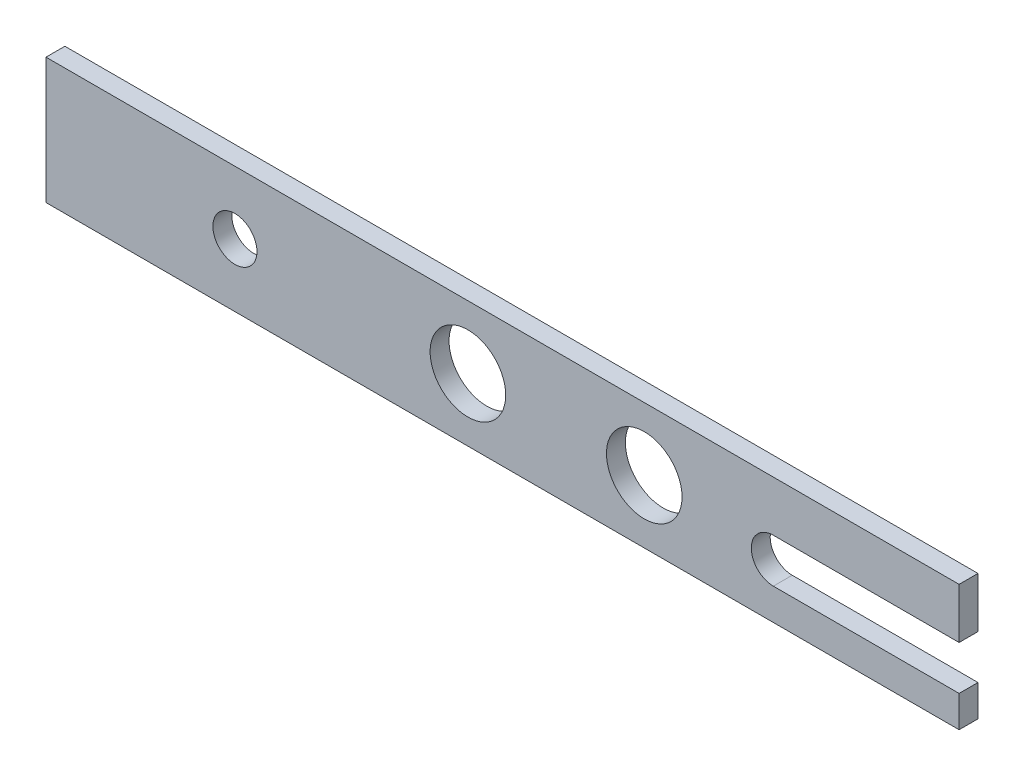
ISO-10303-21;
HEADER;
FILE_DESCRIPTION(('STEP AP214'),'2;1');
FILE_NAME('part.step','',(''),(''),'','','');
FILE_SCHEMA(('AUTOMOTIVE_DESIGN { 1 0 10303 214 1 1 1 1 }'));
ENDSEC;
DATA;
#1=APPLICATION_CONTEXT('core data for automotive mechanical design processes');
#2=APPLICATION_PROTOCOL_DEFINITION('international standard','automotive_design',2000,#1);
#3=PRODUCT_CONTEXT('',#1,'mechanical');
#4=PRODUCT('Part','Part','',(#3));
#5=PRODUCT_RELATED_PRODUCT_CATEGORY('part','',(#4));
#6=PRODUCT_DEFINITION_FORMATION('','',#4);
#7=PRODUCT_DEFINITION_CONTEXT('part definition',#1,'design');
#8=PRODUCT_DEFINITION('design','',#6,#7);
#9=PRODUCT_DEFINITION_SHAPE('','',#8);
#10=(LENGTH_UNIT() NAMED_UNIT(*) SI_UNIT(.MILLI.,.METRE.));
#11=(NAMED_UNIT(*) PLANE_ANGLE_UNIT() SI_UNIT($,.RADIAN.));
#12=(NAMED_UNIT(*) SI_UNIT($,.STERADIAN.) SOLID_ANGLE_UNIT());
#13=UNCERTAINTY_MEASURE_WITH_UNIT(LENGTH_MEASURE(1.E-05),#10,'distance_accuracy_value','');
#14=(GEOMETRIC_REPRESENTATION_CONTEXT(3) GLOBAL_UNCERTAINTY_ASSIGNED_CONTEXT((#13)) GLOBAL_UNIT_ASSIGNED_CONTEXT((#10,
#11,#12)) REPRESENTATION_CONTEXT('',''));
#15=CARTESIAN_POINT('',(0.,0.,0.));
#16=DIRECTION('',(0.,0.,1.));
#17=DIRECTION('',(1.,0.,0.));
#18=AXIS2_PLACEMENT_3D('',#15,#16,#17);
#19=CARTESIAN_POINT('',(0.,4.99999999999998,3.));
#20=DIRECTION('',(0.,-1.,0.));
#21=DIRECTION('',(1.,0.,0.));
#22=AXIS2_PLACEMENT_3D('',#19,#20,#21);
#23=PLANE('',#22);
#24=DIRECTION('',(-1.,0.,0.));
#25=VECTOR('',#24,1.);
#26=CARTESIAN_POINT('',(0.,4.99999999999998,0.));
#27=LINE('',#26,#25);
#28=CARTESIAN_POINT('',(145.,5.,0.));
#29=VERTEX_POINT('',#28);
#30=CARTESIAN_POINT('',(115.5,5.,0.));
#31=VERTEX_POINT('',#30);
#32=EDGE_CURVE('E154',#29,#31,#27,.T.);
#33=ORIENTED_EDGE('',*,*,#32,.T.);
#34=DIRECTION('',(0.,0.,-1.));
#35=VECTOR('',#34,1.);
#36=CARTESIAN_POINT('',(115.5,5.,3.));
#37=LINE('',#36,#35);
#38=CARTESIAN_POINT('',(115.5,5.,3.));
#39=VERTEX_POINT('',#38);
#40=EDGE_CURVE('E11',#39,#31,#37,.T.);
#41=ORIENTED_EDGE('',*,*,#40,.F.);
#42=DIRECTION('',(-1.,0.,0.));
#43=VECTOR('',#42,1.);
#44=CARTESIAN_POINT('',(0.,4.99999999999998,3.));
#45=LINE('',#44,#43);
#46=CARTESIAN_POINT('',(145.,5.,3.));
#47=VERTEX_POINT('',#46);
#48=EDGE_CURVE('E212',#47,#39,#45,.T.);
#49=ORIENTED_EDGE('',*,*,#48,.F.);
#50=DIRECTION('',(0.,0.,-1.));
#51=VECTOR('',#50,1.);
#52=CARTESIAN_POINT('',(145.,5.,3.));
#53=LINE('',#52,#51);
#54=EDGE_CURVE('E178',#47,#29,#53,.T.);
#55=ORIENTED_EDGE('',*,*,#54,.T.);
#56=EDGE_LOOP('',(#33,#41,#49,#55));
#57=FACE_BOUND('',#56,.T.);
#58=ADVANCED_FACE('F41',(#57),#23,.F.);
#59=CARTESIAN_POINT('',(115.5,8.5,3.));
#60=DIRECTION('',(0.,0.,-1.));
#61=DIRECTION('',(-1.,0.,0.));
#62=AXIS2_PLACEMENT_3D('',#59,#60,#61);
#63=CYLINDRICAL_SURFACE('',#62,3.5);
#64=CARTESIAN_POINT('',(115.5,8.5,0.));
#65=DIRECTION('',(0.,0.,1.));
#66=DIRECTION('',(1.,0.,0.));
#67=AXIS2_PLACEMENT_3D('',#64,#65,#66);
#68=CIRCLE('',#67,3.5);
#69=CARTESIAN_POINT('',(115.5,12.,0.));
#70=VERTEX_POINT('',#69);
#71=EDGE_CURVE('E158',#31,#70,#68,.F.);
#72=ORIENTED_EDGE('',*,*,#71,.T.);
#73=DIRECTION('',(0.,0.,-1.));
#74=VECTOR('',#73,1.);
#75=CARTESIAN_POINT('',(115.5,12.,3.));
#76=LINE('',#75,#74);
#77=CARTESIAN_POINT('',(115.5,12.,3.));
#78=VERTEX_POINT('',#77);
#79=EDGE_CURVE('E51',#78,#70,#76,.T.);
#80=ORIENTED_EDGE('',*,*,#79,.F.);
#81=CARTESIAN_POINT('',(115.5,8.5,3.));
#82=DIRECTION('',(0.,0.,1.));
#83=DIRECTION('',(1.,0.,0.));
#84=AXIS2_PLACEMENT_3D('',#81,#82,#83);
#85=CIRCLE('',#84,3.5);
#86=EDGE_CURVE('E101',#39,#78,#85,.F.);
#87=ORIENTED_EDGE('',*,*,#86,.F.);
#88=ORIENTED_EDGE('',*,*,#40,.T.);
#89=EDGE_LOOP('',(#72,#80,#87,#88));
#90=FACE_BOUND('',#89,.T.);
#91=ADVANCED_FACE('F197',(#90),#63,.F.);
#92=CARTESIAN_POINT('',(0.,12.,3.));
#93=DIRECTION('',(0.,-1.,0.));
#94=DIRECTION('',(1.,0.,0.));
#95=AXIS2_PLACEMENT_3D('',#92,#93,#94);
#96=PLANE('',#95);
#97=DIRECTION('',(-1.,0.,0.));
#98=VECTOR('',#97,1.);
#99=CARTESIAN_POINT('',(0.,12.,0.));
#100=LINE('',#99,#98);
#101=CARTESIAN_POINT('',(145.,12.,0.));
#102=VERTEX_POINT('',#101);
#103=EDGE_CURVE('E162',#102,#70,#100,.T.);
#104=ORIENTED_EDGE('',*,*,#103,.F.);
#105=DIRECTION('',(0.,0.,-1.));
#106=VECTOR('',#105,1.);
#107=CARTESIAN_POINT('',(145.,12.,3.));
#108=LINE('',#107,#106);
#109=CARTESIAN_POINT('',(145.,12.,3.));
#110=VERTEX_POINT('',#109);
#111=EDGE_CURVE('E188',#110,#102,#108,.T.);
#112=ORIENTED_EDGE('',*,*,#111,.F.);
#113=DIRECTION('',(-1.,0.,0.));
#114=VECTOR('',#113,1.);
#115=CARTESIAN_POINT('',(0.,12.,3.));
#116=LINE('',#115,#114);
#117=EDGE_CURVE('E196',#110,#78,#116,.T.);
#118=ORIENTED_EDGE('',*,*,#117,.T.);
#119=ORIENTED_EDGE('',*,*,#79,.T.);
#120=EDGE_LOOP('',(#104,#112,#118,#119));
#121=FACE_BOUND('',#120,.T.);
#122=ADVANCED_FACE('F194',(#121),#96,.T.);
#123=CARTESIAN_POINT('',(145.,0.,3.));
#124=DIRECTION('',(-1.,0.,0.));
#125=DIRECTION('',(0.,0.,1.));
#126=AXIS2_PLACEMENT_3D('',#123,#124,#125);
#127=PLANE('',#126);
#128=DIRECTION('',(0.,1.,0.));
#129=VECTOR('',#128,1.);
#130=CARTESIAN_POINT('',(145.,0.,0.));
#131=LINE('',#130,#129);
#132=CARTESIAN_POINT('',(145.,20.,0.));
#133=VERTEX_POINT('',#132);
#134=EDGE_CURVE('E166',#102,#133,#131,.T.);
#135=ORIENTED_EDGE('',*,*,#134,.T.);
#136=DIRECTION('',(0.,0.,-1.));
#137=VECTOR('',#136,1.);
#138=CARTESIAN_POINT('',(145.,20.,3.));
#139=LINE('',#138,#137);
#140=CARTESIAN_POINT('',(145.,20.,3.));
#141=VERTEX_POINT('',#140);
#142=EDGE_CURVE('E185',#141,#133,#139,.T.);
#143=ORIENTED_EDGE('',*,*,#142,.F.);
#144=DIRECTION('',(0.,1.,0.));
#145=VECTOR('',#144,1.);
#146=CARTESIAN_POINT('',(145.,0.,3.));
#147=LINE('',#146,#145);
#148=EDGE_CURVE('E138',#110,#141,#147,.T.);
#149=ORIENTED_EDGE('',*,*,#148,.F.);
#150=ORIENTED_EDGE('',*,*,#111,.T.);
#151=EDGE_LOOP('',(#135,#143,#149,#150));
#152=FACE_BOUND('',#151,.T.);
#153=ADVANCED_FACE('F206',(#152),#127,.F.);
#154=CARTESIAN_POINT('',(0.,20.,3.));
#155=DIRECTION('',(0.,1.,0.));
#156=DIRECTION('',(0.,0.,1.));
#157=AXIS2_PLACEMENT_3D('',#154,#155,#156);
#158=PLANE('',#157);
#159=DIRECTION('',(1.,0.,0.));
#160=VECTOR('',#159,1.);
#161=CARTESIAN_POINT('',(0.,20.,0.));
#162=LINE('',#161,#160);
#163=CARTESIAN_POINT('',(0.,20.,0.));
#164=VERTEX_POINT('',#163);
#165=EDGE_CURVE('E170',#164,#133,#162,.T.);
#166=ORIENTED_EDGE('',*,*,#165,.F.);
#167=DIRECTION('',(0.,0.,-1.));
#168=VECTOR('',#167,1.);
#169=CARTESIAN_POINT('',(0.,20.,3.));
#170=LINE('',#169,#168);
#171=CARTESIAN_POINT('',(0.,20.,3.));
#172=VERTEX_POINT('',#171);
#173=EDGE_CURVE('E124',#172,#164,#170,.T.);
#174=ORIENTED_EDGE('',*,*,#173,.F.);
#175=DIRECTION('',(1.,0.,0.));
#176=VECTOR('',#175,1.);
#177=CARTESIAN_POINT('',(0.,20.,3.));
#178=LINE('',#177,#176);
#179=EDGE_CURVE('E134',#172,#141,#178,.T.);
#180=ORIENTED_EDGE('',*,*,#179,.T.);
#181=ORIENTED_EDGE('',*,*,#142,.T.);
#182=EDGE_LOOP('',(#166,#174,#180,#181));
#183=FACE_BOUND('',#182,.T.);
#184=ADVANCED_FACE('F277',(#183),#158,.T.);
#185=CARTESIAN_POINT('',(0.,0.,3.));
#186=DIRECTION('',(-1.,0.,0.));
#187=DIRECTION('',(0.,0.,1.));
#188=AXIS2_PLACEMENT_3D('',#185,#186,#187);
#189=PLANE('',#188);
#190=DIRECTION('',(0.,1.,0.));
#191=VECTOR('',#190,1.);
#192=CARTESIAN_POINT('',(0.,0.,0.));
#193=LINE('',#192,#191);
#194=CARTESIAN_POINT('',(0.,0.,0.));
#195=VERTEX_POINT('',#194);
#196=EDGE_CURVE('E122',#195,#164,#193,.T.);
#197=ORIENTED_EDGE('',*,*,#196,.F.);
#198=DIRECTION('',(0.,0.,-1.));
#199=VECTOR('',#198,1.);
#200=CARTESIAN_POINT('',(0.,0.,3.));
#201=LINE('',#200,#199);
#202=CARTESIAN_POINT('',(0.,0.,3.));
#203=VERTEX_POINT('',#202);
#204=EDGE_CURVE('E116',#203,#195,#201,.T.);
#205=ORIENTED_EDGE('',*,*,#204,.F.);
#206=DIRECTION('',(0.,1.,0.));
#207=VECTOR('',#206,1.);
#208=CARTESIAN_POINT('',(0.,0.,3.));
#209=LINE('',#208,#207);
#210=EDGE_CURVE('E120',#203,#172,#209,.T.);
#211=ORIENTED_EDGE('',*,*,#210,.T.);
#212=ORIENTED_EDGE('',*,*,#173,.T.);
#213=EDGE_LOOP('',(#197,#205,#211,#212));
#214=FACE_BOUND('',#213,.T.);
#215=ADVANCED_FACE('F118',(#214),#189,.T.);
#216=CARTESIAN_POINT('',(0.,0.,3.));
#217=DIRECTION('',(0.,1.,0.));
#218=DIRECTION('',(0.,0.,1.));
#219=AXIS2_PLACEMENT_3D('',#216,#217,#218);
#220=PLANE('',#219);
#221=DIRECTION('',(1.,0.,0.));
#222=VECTOR('',#221,1.);
#223=CARTESIAN_POINT('',(0.,0.,0.));
#224=LINE('',#223,#222);
#225=CARTESIAN_POINT('',(145.,0.,0.));
#226=VERTEX_POINT('',#225);
#227=EDGE_CURVE('E87',#195,#226,#224,.T.);
#228=ORIENTED_EDGE('',*,*,#227,.T.);
#229=DIRECTION('',(0.,0.,-1.));
#230=VECTOR('',#229,1.);
#231=CARTESIAN_POINT('',(145.,0.,3.));
#232=LINE('',#231,#230);
#233=CARTESIAN_POINT('',(145.,0.,3.));
#234=VERTEX_POINT('',#233);
#235=EDGE_CURVE('E125',#234,#226,#232,.T.);
#236=ORIENTED_EDGE('',*,*,#235,.F.);
#237=DIRECTION('',(1.,0.,0.));
#238=VECTOR('',#237,1.);
#239=CARTESIAN_POINT('',(0.,0.,3.));
#240=LINE('',#239,#238);
#241=EDGE_CURVE('E127',#203,#234,#240,.T.);
#242=ORIENTED_EDGE('',*,*,#241,.F.);
#243=ORIENTED_EDGE('',*,*,#204,.T.);
#244=EDGE_LOOP('',(#228,#236,#242,#243));
#245=FACE_BOUND('',#244,.T.);
#246=ADVANCED_FACE('F128',(#245),#220,.F.);
#247=CARTESIAN_POINT('',(30.,10.,3.));
#248=DIRECTION('',(0.,0.,-1.));
#249=DIRECTION('',(-1.,0.,0.));
#250=AXIS2_PLACEMENT_3D('',#247,#248,#249);
#251=CYLINDRICAL_SURFACE('',#250,3.5);
#252=CARTESIAN_POINT('',(30.,10.,3.));
#253=DIRECTION('',(0.,0.,1.));
#254=DIRECTION('',(1.,0.,0.));
#255=AXIS2_PLACEMENT_3D('',#252,#253,#254);
#256=CIRCLE('',#255,3.5);
#257=CARTESIAN_POINT('',(33.5,10.,3.));
#258=VERTEX_POINT('',#257);
#259=EDGE_CURVE('E217',#258,#258,#256,.T.);
#260=ORIENTED_EDGE('',*,*,#259,.T.);
#261=EDGE_LOOP('',(#260));
#262=FACE_BOUND('',#261,.T.);
#263=CARTESIAN_POINT('',(30.,10.,0.));
#264=DIRECTION('',(0.,0.,1.));
#265=DIRECTION('',(1.,0.,0.));
#266=AXIS2_PLACEMENT_3D('',#263,#264,#265);
#267=CIRCLE('',#266,3.5);
#268=CARTESIAN_POINT('',(33.5,10.,0.));
#269=VERTEX_POINT('',#268);
#270=EDGE_CURVE('E150',#269,#269,#267,.T.);
#271=ORIENTED_EDGE('',*,*,#270,.F.);
#272=EDGE_LOOP('',(#271));
#273=FACE_BOUND('',#272,.T.);
#274=ADVANCED_FACE('F241',(#262,#273),#251,.F.);
#275=CARTESIAN_POINT('',(67.,10.,3.));
#276=DIRECTION('',(0.,0.,-1.));
#277=DIRECTION('',(-1.,0.,0.));
#278=AXIS2_PLACEMENT_3D('',#275,#276,#277);
#279=CYLINDRICAL_SURFACE('',#278,6.);
#280=CARTESIAN_POINT('',(67.,10.,3.));
#281=DIRECTION('',(0.,0.,1.));
#282=DIRECTION('',(1.,0.,0.));
#283=AXIS2_PLACEMENT_3D('',#280,#281,#282);
#284=CIRCLE('',#283,6.);
#285=CARTESIAN_POINT('',(73.,10.,3.));
#286=VERTEX_POINT('',#285);
#287=EDGE_CURVE('E221',#286,#286,#284,.T.);
#288=ORIENTED_EDGE('',*,*,#287,.T.);
#289=EDGE_LOOP('',(#288));
#290=FACE_BOUND('',#289,.T.);
#291=CARTESIAN_POINT('',(67.,10.,0.));
#292=DIRECTION('',(0.,0.,1.));
#293=DIRECTION('',(1.,0.,0.));
#294=AXIS2_PLACEMENT_3D('',#291,#292,#293);
#295=CIRCLE('',#294,6.);
#296=CARTESIAN_POINT('',(73.,10.,0.));
#297=VERTEX_POINT('',#296);
#298=EDGE_CURVE('E146',#297,#297,#295,.T.);
#299=ORIENTED_EDGE('',*,*,#298,.F.);
#300=EDGE_LOOP('',(#299));
#301=FACE_BOUND('',#300,.T.);
#302=ADVANCED_FACE('F244',(#290,#301),#279,.F.);
#303=CARTESIAN_POINT('',(95.,10.,3.));
#304=DIRECTION('',(0.,0.,-1.));
#305=DIRECTION('',(-1.,0.,0.));
#306=AXIS2_PLACEMENT_3D('',#303,#304,#305);
#307=CYLINDRICAL_SURFACE('',#306,6.);
#308=CARTESIAN_POINT('',(95.,10.,3.));
#309=DIRECTION('',(0.,0.,1.));
#310=DIRECTION('',(1.,0.,0.));
#311=AXIS2_PLACEMENT_3D('',#308,#309,#310);
#312=CIRCLE('',#311,6.);
#313=CARTESIAN_POINT('',(101.,10.,3.));
#314=VERTEX_POINT('',#313);
#315=EDGE_CURVE('E225',#314,#314,#312,.T.);
#316=ORIENTED_EDGE('',*,*,#315,.T.);
#317=EDGE_LOOP('',(#316));
#318=FACE_BOUND('',#317,.T.);
#319=CARTESIAN_POINT('',(95.,10.,0.));
#320=DIRECTION('',(0.,0.,1.));
#321=DIRECTION('',(1.,0.,0.));
#322=AXIS2_PLACEMENT_3D('',#319,#320,#321);
#323=CIRCLE('',#322,6.);
#324=CARTESIAN_POINT('',(101.,10.,0.));
#325=VERTEX_POINT('',#324);
#326=EDGE_CURVE('E142',#325,#325,#323,.T.);
#327=ORIENTED_EDGE('',*,*,#326,.F.);
#328=EDGE_LOOP('',(#327));
#329=FACE_BOUND('',#328,.T.);
#330=ADVANCED_FACE('F43',(#318,#329),#307,.F.);
#331=EDGE_CURVE('E93',#226,#29,#131,.T.);
#332=ORIENTED_EDGE('',*,*,#331,.T.);
#333=ORIENTED_EDGE('',*,*,#54,.F.);
#334=EDGE_CURVE('E59',#234,#47,#147,.T.);
#335=ORIENTED_EDGE('',*,*,#334,.F.);
#336=ORIENTED_EDGE('',*,*,#235,.T.);
#337=EDGE_LOOP('',(#332,#333,#335,#336));
#338=FACE_BOUND('',#337,.T.);
#339=ADVANCED_FACE('F235',(#338),#127,.F.);
#340=CARTESIAN_POINT('',(0.,0.,3.));
#341=DIRECTION('',(0.,0.,1.));
#342=DIRECTION('',(1.,0.,0.));
#343=AXIS2_PLACEMENT_3D('',#340,#341,#342);
#344=PLANE('',#343);
#345=ORIENTED_EDGE('',*,*,#315,.F.);
#346=EDGE_LOOP('',(#345));
#347=FACE_BOUND('',#346,.T.);
#348=ORIENTED_EDGE('',*,*,#287,.F.);
#349=EDGE_LOOP('',(#348));
#350=FACE_BOUND('',#349,.T.);
#351=ORIENTED_EDGE('',*,*,#259,.F.);
#352=EDGE_LOOP('',(#351));
#353=FACE_BOUND('',#352,.T.);
#354=ORIENTED_EDGE('',*,*,#48,.T.);
#355=ORIENTED_EDGE('',*,*,#86,.T.);
#356=ORIENTED_EDGE('',*,*,#117,.F.);
#357=ORIENTED_EDGE('',*,*,#148,.T.);
#358=ORIENTED_EDGE('',*,*,#179,.F.);
#359=ORIENTED_EDGE('',*,*,#210,.F.);
#360=ORIENTED_EDGE('',*,*,#241,.T.);
#361=ORIENTED_EDGE('',*,*,#334,.T.);
#362=EDGE_LOOP('',(#354,#355,#356,#357,#358,#359,#360,#361));
#363=FACE_BOUND('',#362,.T.);
#364=ADVANCED_FACE('F132',(#347,#350,#353,#363),#344,.T.);
#365=CARTESIAN_POINT('',(0.,0.,0.));
#366=DIRECTION('',(0.,0.,1.));
#367=DIRECTION('',(1.,0.,0.));
#368=AXIS2_PLACEMENT_3D('',#365,#366,#367);
#369=PLANE('',#368);
#370=ORIENTED_EDGE('',*,*,#326,.T.);
#371=EDGE_LOOP('',(#370));
#372=FACE_BOUND('',#371,.T.);
#373=ORIENTED_EDGE('',*,*,#298,.T.);
#374=EDGE_LOOP('',(#373));
#375=FACE_BOUND('',#374,.T.);
#376=ORIENTED_EDGE('',*,*,#270,.T.);
#377=EDGE_LOOP('',(#376));
#378=FACE_BOUND('',#377,.T.);
#379=ORIENTED_EDGE('',*,*,#32,.F.);
#380=ORIENTED_EDGE('',*,*,#331,.F.);
#381=ORIENTED_EDGE('',*,*,#227,.F.);
#382=ORIENTED_EDGE('',*,*,#196,.T.);
#383=ORIENTED_EDGE('',*,*,#165,.T.);
#384=ORIENTED_EDGE('',*,*,#134,.F.);
#385=ORIENTED_EDGE('',*,*,#103,.T.);
#386=ORIENTED_EDGE('',*,*,#71,.F.);
#387=EDGE_LOOP('',(#379,#380,#381,#382,#383,#384,#385,#386));
#388=FACE_BOUND('',#387,.T.);
#389=ADVANCED_FACE('F202',(#372,#375,#378,#388),#369,.F.);
#390=CLOSED_SHELL('',(#58,#91,#122,#153,#184,#215,#246,#274,#302,#330,#339,#364,#389));
#391=MANIFOLD_SOLID_BREP('B2',#390);
#392=ADVANCED_BREP_SHAPE_REPRESENTATION('',(#18,#391),#14);
#393=SHAPE_DEFINITION_REPRESENTATION(#9,#392);
ENDSEC;
END-ISO-10303-21;
